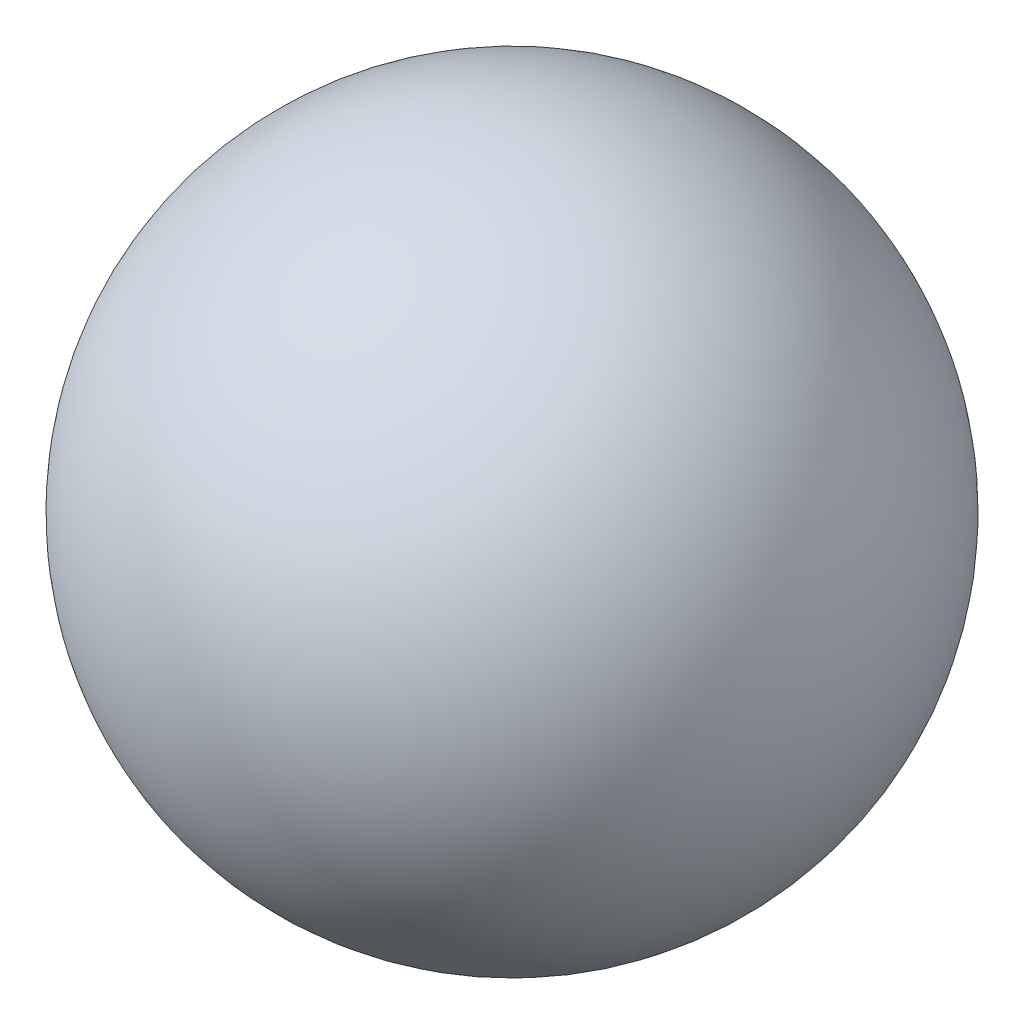
ISO-10303-21;
HEADER;
FILE_DESCRIPTION(('STEP AP214'),'2;1');
FILE_NAME('part.step','',(''),(''),'','','');
FILE_SCHEMA(('AUTOMOTIVE_DESIGN { 1 0 10303 214 1 1 1 1 }'));
ENDSEC;
DATA;
#1=APPLICATION_CONTEXT('core data for automotive mechanical design processes');
#2=APPLICATION_PROTOCOL_DEFINITION('international standard','automotive_design',2000,#1);
#3=PRODUCT_CONTEXT('',#1,'mechanical');
#4=PRODUCT('Part','Part','',(#3));
#5=PRODUCT_RELATED_PRODUCT_CATEGORY('part','',(#4));
#6=PRODUCT_DEFINITION_FORMATION('','',#4);
#7=PRODUCT_DEFINITION_CONTEXT('part definition',#1,'design');
#8=PRODUCT_DEFINITION('design','',#6,#7);
#9=PRODUCT_DEFINITION_SHAPE('','',#8);
#10=(LENGTH_UNIT() NAMED_UNIT(*) SI_UNIT(.MILLI.,.METRE.));
#11=(NAMED_UNIT(*) PLANE_ANGLE_UNIT() SI_UNIT($,.RADIAN.));
#12=(NAMED_UNIT(*) SI_UNIT($,.STERADIAN.) SOLID_ANGLE_UNIT());
#13=UNCERTAINTY_MEASURE_WITH_UNIT(LENGTH_MEASURE(1.E-05),#10,'distance_accuracy_value','');
#14=(GEOMETRIC_REPRESENTATION_CONTEXT(3) GLOBAL_UNCERTAINTY_ASSIGNED_CONTEXT((#13)) GLOBAL_UNIT_ASSIGNED_CONTEXT((#10,
#11,#12)) REPRESENTATION_CONTEXT('',''));
#15=CARTESIAN_POINT('',(0.,0.,0.));
#16=DIRECTION('',(0.,0.,1.));
#17=DIRECTION('',(1.,0.,0.));
#18=AXIS2_PLACEMENT_3D('',#15,#16,#17);
#19=CARTESIAN_POINT('',(-6.35252960510327,-2.,9.88472901076638));
#20=DIRECTION('',(0.,0.,1.));
#21=DIRECTION('',(1.,0.,0.));
#22=AXIS2_PLACEMENT_3D('',#19,#20,#21);
#23=SPHERICAL_SURFACE('',#22,1.05);
#24=CARTESIAN_POINT('',(-6.35252960510327,-2.,10.9347290107664));
#25=VERTEX_POINT('',#24);
#26=VERTEX_LOOP('',#25);
#27=FACE_BOUND('',#26,.T.);
#28=ADVANCED_FACE('F13',(#27),#23,.T.);
#29=CLOSED_SHELL('',(#28));
#30=MANIFOLD_SOLID_BREP('B1',#29);
#31=ADVANCED_BREP_SHAPE_REPRESENTATION('',(#18,#30),#14);
#32=SHAPE_DEFINITION_REPRESENTATION(#9,#31);
ENDSEC;
END-ISO-10303-21;
